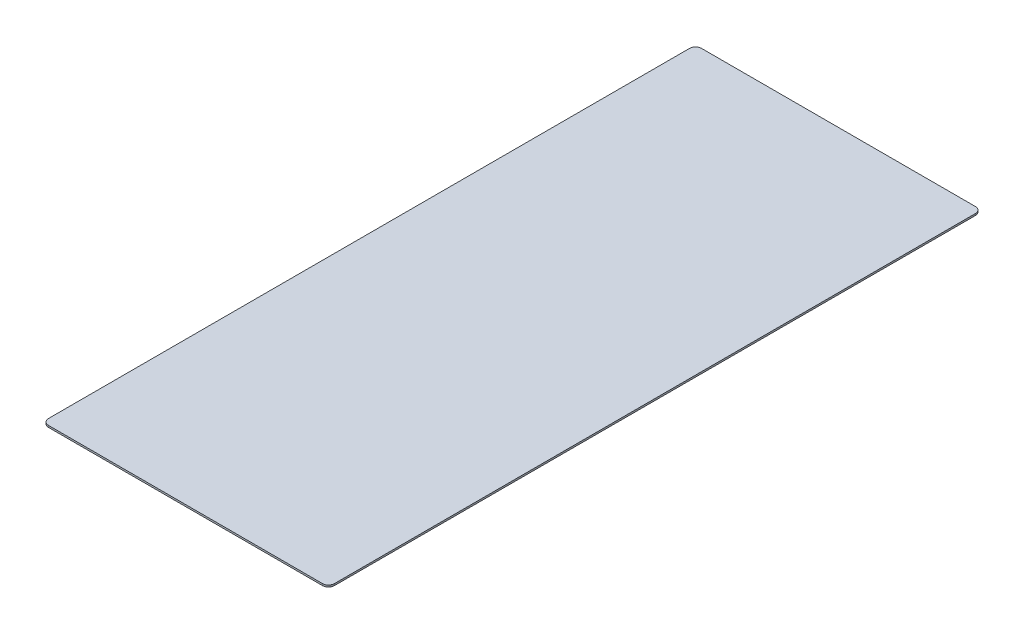
ISO-10303-21;
HEADER;
FILE_DESCRIPTION(('STEP AP214'),'2;1');
FILE_NAME('part.step','',(''),(''),'','','');
FILE_SCHEMA(('AUTOMOTIVE_DESIGN { 1 0 10303 214 1 1 1 1 }'));
ENDSEC;
DATA;
#1=APPLICATION_CONTEXT('core data for automotive mechanical design processes');
#2=APPLICATION_PROTOCOL_DEFINITION('international standard','automotive_design',2000,#1);
#3=PRODUCT_CONTEXT('',#1,'mechanical');
#4=PRODUCT('Part','Part','',(#3));
#5=PRODUCT_RELATED_PRODUCT_CATEGORY('part','',(#4));
#6=PRODUCT_DEFINITION_FORMATION('','',#4);
#7=PRODUCT_DEFINITION_CONTEXT('part definition',#1,'design');
#8=PRODUCT_DEFINITION('design','',#6,#7);
#9=PRODUCT_DEFINITION_SHAPE('','',#8);
#10=(LENGTH_UNIT() NAMED_UNIT(*) SI_UNIT(.MILLI.,.METRE.));
#11=(NAMED_UNIT(*) PLANE_ANGLE_UNIT() SI_UNIT($,.RADIAN.));
#12=(NAMED_UNIT(*) SI_UNIT($,.STERADIAN.) SOLID_ANGLE_UNIT());
#13=UNCERTAINTY_MEASURE_WITH_UNIT(LENGTH_MEASURE(1.E-05),#10,'distance_accuracy_value','');
#14=(GEOMETRIC_REPRESENTATION_CONTEXT(3) GLOBAL_UNCERTAINTY_ASSIGNED_CONTEXT((#13)) GLOBAL_UNIT_ASSIGNED_CONTEXT((#10,
#11,#12)) REPRESENTATION_CONTEXT('',''));
#15=CARTESIAN_POINT('',(0.,0.,0.));
#16=DIRECTION('',(0.,0.,1.));
#17=DIRECTION('',(1.,0.,0.));
#18=AXIS2_PLACEMENT_3D('',#15,#16,#17);
#19=CARTESIAN_POINT('',(231.5,3.,541.5));
#20=DIRECTION('',(0.,-1.,0.));
#21=DIRECTION('',(0.,0.,-1.));
#22=AXIS2_PLACEMENT_3D('',#19,#20,#21);
#23=CYLINDRICAL_SURFACE('',#22,10.);
#24=CARTESIAN_POINT('',(231.5,0.,541.5));
#25=DIRECTION('',(0.,1.,0.));
#26=DIRECTION('',(0.,0.,1.));
#27=AXIS2_PLACEMENT_3D('',#24,#25,#26);
#28=CIRCLE('',#27,10.);
#29=CARTESIAN_POINT('',(231.5,0.,551.5));
#30=VERTEX_POINT('',#29);
#31=CARTESIAN_POINT('',(241.5,0.,541.5));
#32=VERTEX_POINT('',#31);
#33=EDGE_CURVE('E140',#30,#32,#28,.T.);
#34=ORIENTED_EDGE('',*,*,#33,.T.);
#35=DIRECTION('',(0.,-1.,0.));
#36=VECTOR('',#35,1.);
#37=CARTESIAN_POINT('',(241.5,3.,541.5));
#38=LINE('',#37,#36);
#39=CARTESIAN_POINT('',(241.5,3.,541.5));
#40=VERTEX_POINT('',#39);
#41=EDGE_CURVE('E11',#40,#32,#38,.T.);
#42=ORIENTED_EDGE('',*,*,#41,.F.);
#43=CARTESIAN_POINT('',(231.5,3.,541.5));
#44=DIRECTION('',(0.,1.,0.));
#45=DIRECTION('',(0.,0.,1.));
#46=AXIS2_PLACEMENT_3D('',#43,#44,#45);
#47=CIRCLE('',#46,10.);
#48=CARTESIAN_POINT('',(231.5,3.,551.5));
#49=VERTEX_POINT('',#48);
#50=EDGE_CURVE('E162',#49,#40,#47,.T.);
#51=ORIENTED_EDGE('',*,*,#50,.F.);
#52=DIRECTION('',(0.,-1.,0.));
#53=VECTOR('',#52,1.);
#54=CARTESIAN_POINT('',(231.5,3.,551.5));
#55=LINE('',#54,#53);
#56=EDGE_CURVE('E136',#49,#30,#55,.T.);
#57=ORIENTED_EDGE('',*,*,#56,.T.);
#58=EDGE_LOOP('',(#34,#42,#51,#57));
#59=FACE_BOUND('',#58,.T.);
#60=ADVANCED_FACE('F39',(#59),#23,.T.);
#61=CARTESIAN_POINT('',(241.5,3.,541.5));
#62=DIRECTION('',(-1.,0.,0.));
#63=DIRECTION('',(0.,0.,1.));
#64=AXIS2_PLACEMENT_3D('',#61,#62,#63);
#65=PLANE('',#64);
#66=DIRECTION('',(0.,0.,-1.));
#67=VECTOR('',#66,1.);
#68=CARTESIAN_POINT('',(241.5,0.,541.5));
#69=LINE('',#68,#67);
#70=CARTESIAN_POINT('',(241.5,0.,-541.5));
#71=VERTEX_POINT('',#70);
#72=EDGE_CURVE('E144',#32,#71,#69,.T.);
#73=ORIENTED_EDGE('',*,*,#72,.T.);
#74=DIRECTION('',(0.,-1.,0.));
#75=VECTOR('',#74,1.);
#76=CARTESIAN_POINT('',(241.5,3.,-541.5));
#77=LINE('',#76,#75);
#78=CARTESIAN_POINT('',(241.5,3.,-541.5));
#79=VERTEX_POINT('',#78);
#80=EDGE_CURVE('E48',#79,#71,#77,.T.);
#81=ORIENTED_EDGE('',*,*,#80,.F.);
#82=DIRECTION('',(0.,0.,-1.));
#83=VECTOR('',#82,1.);
#84=CARTESIAN_POINT('',(241.5,3.,541.5));
#85=LINE('',#84,#83);
#86=EDGE_CURVE('E99',#40,#79,#85,.T.);
#87=ORIENTED_EDGE('',*,*,#86,.F.);
#88=ORIENTED_EDGE('',*,*,#41,.T.);
#89=EDGE_LOOP('',(#73,#81,#87,#88));
#90=FACE_BOUND('',#89,.T.);
#91=ADVANCED_FACE('F208',(#90),#65,.F.);
#92=CARTESIAN_POINT('',(231.5,3.,-541.5));
#93=DIRECTION('',(0.,-1.,0.));
#94=DIRECTION('',(0.,0.,-1.));
#95=AXIS2_PLACEMENT_3D('',#92,#93,#94);
#96=CYLINDRICAL_SURFACE('',#95,10.);
#97=CARTESIAN_POINT('',(231.5,0.,-541.5));
#98=DIRECTION('',(0.,1.,0.));
#99=DIRECTION('',(0.,0.,-1.));
#100=AXIS2_PLACEMENT_3D('',#97,#98,#99);
#101=CIRCLE('',#100,10.);
#102=CARTESIAN_POINT('',(231.5,0.,-551.5));
#103=VERTEX_POINT('',#102);
#104=EDGE_CURVE('E147',#71,#103,#101,.T.);
#105=ORIENTED_EDGE('',*,*,#104,.T.);
#106=DIRECTION('',(0.,-1.,0.));
#107=VECTOR('',#106,1.);
#108=CARTESIAN_POINT('',(231.5,3.,-551.5));
#109=LINE('',#108,#107);
#110=CARTESIAN_POINT('',(231.5,3.,-551.5));
#111=VERTEX_POINT('',#110);
#112=EDGE_CURVE('E173',#111,#103,#109,.T.);
#113=ORIENTED_EDGE('',*,*,#112,.F.);
#114=CARTESIAN_POINT('',(231.5,3.,-541.5));
#115=DIRECTION('',(0.,1.,0.));
#116=DIRECTION('',(0.,0.,-1.));
#117=AXIS2_PLACEMENT_3D('',#114,#115,#116);
#118=CIRCLE('',#117,10.);
#119=EDGE_CURVE('E183',#79,#111,#118,.T.);
#120=ORIENTED_EDGE('',*,*,#119,.F.);
#121=ORIENTED_EDGE('',*,*,#80,.T.);
#122=EDGE_LOOP('',(#105,#113,#120,#121));
#123=FACE_BOUND('',#122,.T.);
#124=ADVANCED_FACE('F181',(#123),#96,.T.);
#125=CARTESIAN_POINT('',(-231.5,3.,-551.5));
#126=DIRECTION('',(0.,0.,1.));
#127=DIRECTION('',(1.,0.,0.));
#128=AXIS2_PLACEMENT_3D('',#125,#126,#127);
#129=PLANE('',#128);
#130=DIRECTION('',(-1.,0.,0.));
#131=VECTOR('',#130,1.);
#132=CARTESIAN_POINT('',(-231.5,0.,-551.5));
#133=LINE('',#132,#131);
#134=CARTESIAN_POINT('',(-231.5,0.,-551.5));
#135=VERTEX_POINT('',#134);
#136=EDGE_CURVE('E150',#103,#135,#133,.T.);
#137=ORIENTED_EDGE('',*,*,#136,.T.);
#138=DIRECTION('',(0.,-1.,0.));
#139=VECTOR('',#138,1.);
#140=CARTESIAN_POINT('',(-231.5,3.,-551.5));
#141=LINE('',#140,#139);
#142=CARTESIAN_POINT('',(-231.5,3.,-551.5));
#143=VERTEX_POINT('',#142);
#144=EDGE_CURVE('E169',#143,#135,#141,.T.);
#145=ORIENTED_EDGE('',*,*,#144,.F.);
#146=DIRECTION('',(-1.,0.,0.));
#147=VECTOR('',#146,1.);
#148=CARTESIAN_POINT('',(-231.5,3.,-551.5));
#149=LINE('',#148,#147);
#150=EDGE_CURVE('E196',#111,#143,#149,.T.);
#151=ORIENTED_EDGE('',*,*,#150,.F.);
#152=ORIENTED_EDGE('',*,*,#112,.T.);
#153=EDGE_LOOP('',(#137,#145,#151,#152));
#154=FACE_BOUND('',#153,.T.);
#155=ADVANCED_FACE('F191',(#154),#129,.F.);
#156=CARTESIAN_POINT('',(-231.5,3.,-541.5));
#157=DIRECTION('',(0.,-1.,0.));
#158=DIRECTION('',(0.,0.,-1.));
#159=AXIS2_PLACEMENT_3D('',#156,#157,#158);
#160=CYLINDRICAL_SURFACE('',#159,10.);
#161=CARTESIAN_POINT('',(-231.5,0.,-541.5));
#162=DIRECTION('',(0.,1.,0.));
#163=DIRECTION('',(0.,0.,-1.));
#164=AXIS2_PLACEMENT_3D('',#161,#162,#163);
#165=CIRCLE('',#164,10.);
#166=CARTESIAN_POINT('',(-241.5,0.,-541.5));
#167=VERTEX_POINT('',#166);
#168=EDGE_CURVE('E153',#135,#167,#165,.T.);
#169=ORIENTED_EDGE('',*,*,#168,.T.);
#170=DIRECTION('',(0.,-1.,0.));
#171=VECTOR('',#170,1.);
#172=CARTESIAN_POINT('',(-241.5,3.,-541.5));
#173=LINE('',#172,#171);
#174=CARTESIAN_POINT('',(-241.5,3.,-541.5));
#175=VERTEX_POINT('',#174);
#176=EDGE_CURVE('E129',#175,#167,#173,.T.);
#177=ORIENTED_EDGE('',*,*,#176,.F.);
#178=CARTESIAN_POINT('',(-231.5,3.,-541.5));
#179=DIRECTION('',(0.,1.,0.));
#180=DIRECTION('',(0.,0.,-1.));
#181=AXIS2_PLACEMENT_3D('',#178,#179,#180);
#182=CIRCLE('',#181,10.);
#183=EDGE_CURVE('E118',#143,#175,#182,.T.);
#184=ORIENTED_EDGE('',*,*,#183,.F.);
#185=ORIENTED_EDGE('',*,*,#144,.T.);
#186=EDGE_LOOP('',(#169,#177,#184,#185));
#187=FACE_BOUND('',#186,.T.);
#188=ADVANCED_FACE('F194',(#187),#160,.T.);
#189=CARTESIAN_POINT('',(-241.5,3.,541.5));
#190=DIRECTION('',(1.,0.,0.));
#191=DIRECTION('',(0.,0.,-1.));
#192=AXIS2_PLACEMENT_3D('',#189,#190,#191);
#193=PLANE('',#192);
#194=DIRECTION('',(0.,0.,1.));
#195=VECTOR('',#194,1.);
#196=CARTESIAN_POINT('',(-241.5,0.,541.5));
#197=LINE('',#196,#195);
#198=CARTESIAN_POINT('',(-241.5,0.,541.5));
#199=VERTEX_POINT('',#198);
#200=EDGE_CURVE('E127',#167,#199,#197,.T.);
#201=ORIENTED_EDGE('',*,*,#200,.T.);
#202=DIRECTION('',(0.,-1.,0.));
#203=VECTOR('',#202,1.);
#204=CARTESIAN_POINT('',(-241.5,3.,541.5));
#205=LINE('',#204,#203);
#206=CARTESIAN_POINT('',(-241.5,3.,541.5));
#207=VERTEX_POINT('',#206);
#208=EDGE_CURVE('E124',#207,#199,#205,.T.);
#209=ORIENTED_EDGE('',*,*,#208,.F.);
#210=DIRECTION('',(0.,0.,1.));
#211=VECTOR('',#210,1.);
#212=CARTESIAN_POINT('',(-241.5,3.,541.5));
#213=LINE('',#212,#211);
#214=EDGE_CURVE('E112',#175,#207,#213,.T.);
#215=ORIENTED_EDGE('',*,*,#214,.F.);
#216=ORIENTED_EDGE('',*,*,#176,.T.);
#217=EDGE_LOOP('',(#201,#209,#215,#216));
#218=FACE_BOUND('',#217,.T.);
#219=ADVANCED_FACE('F125',(#218),#193,.F.);
#220=CARTESIAN_POINT('',(-231.5,3.,541.5));
#221=DIRECTION('',(0.,-1.,0.));
#222=DIRECTION('',(0.,0.,-1.));
#223=AXIS2_PLACEMENT_3D('',#220,#221,#222);
#224=CYLINDRICAL_SURFACE('',#223,10.);
#225=CARTESIAN_POINT('',(-231.5,0.,541.5));
#226=DIRECTION('',(0.,1.,0.));
#227=DIRECTION('',(0.,0.,-1.));
#228=AXIS2_PLACEMENT_3D('',#225,#226,#227);
#229=CIRCLE('',#228,10.);
#230=CARTESIAN_POINT('',(-231.5,0.,551.5));
#231=VERTEX_POINT('',#230);
#232=EDGE_CURVE('E85',#199,#231,#229,.T.);
#233=ORIENTED_EDGE('',*,*,#232,.T.);
#234=DIRECTION('',(0.,-1.,0.));
#235=VECTOR('',#234,1.);
#236=CARTESIAN_POINT('',(-231.5,3.,551.5));
#237=LINE('',#236,#235);
#238=CARTESIAN_POINT('',(-231.5,3.,551.5));
#239=VERTEX_POINT('',#238);
#240=EDGE_CURVE('E130',#239,#231,#237,.T.);
#241=ORIENTED_EDGE('',*,*,#240,.F.);
#242=CARTESIAN_POINT('',(-231.5,3.,541.5));
#243=DIRECTION('',(0.,1.,0.));
#244=DIRECTION('',(0.,0.,-1.));
#245=AXIS2_PLACEMENT_3D('',#242,#243,#244);
#246=CIRCLE('',#245,10.);
#247=EDGE_CURVE('E116',#207,#239,#246,.T.);
#248=ORIENTED_EDGE('',*,*,#247,.F.);
#249=ORIENTED_EDGE('',*,*,#208,.T.);
#250=EDGE_LOOP('',(#233,#241,#248,#249));
#251=FACE_BOUND('',#250,.T.);
#252=ADVANCED_FACE('F132',(#251),#224,.T.);
#253=CARTESIAN_POINT('',(-231.5,3.,551.5));
#254=DIRECTION('',(0.,0.,-1.));
#255=DIRECTION('',(-1.,0.,0.));
#256=AXIS2_PLACEMENT_3D('',#253,#254,#255);
#257=PLANE('',#256);
#258=DIRECTION('',(1.,0.,0.));
#259=VECTOR('',#258,1.);
#260=CARTESIAN_POINT('',(-231.5,0.,551.5));
#261=LINE('',#260,#259);
#262=EDGE_CURVE('E91',#231,#30,#261,.T.);
#263=ORIENTED_EDGE('',*,*,#262,.T.);
#264=ORIENTED_EDGE('',*,*,#56,.F.);
#265=DIRECTION('',(1.,0.,0.));
#266=VECTOR('',#265,1.);
#267=CARTESIAN_POINT('',(-231.5,3.,551.5));
#268=LINE('',#267,#266);
#269=EDGE_CURVE('E56',#239,#49,#268,.T.);
#270=ORIENTED_EDGE('',*,*,#269,.F.);
#271=ORIENTED_EDGE('',*,*,#240,.T.);
#272=EDGE_LOOP('',(#263,#264,#270,#271));
#273=FACE_BOUND('',#272,.T.);
#274=ADVANCED_FACE('F224',(#273),#257,.F.);
#275=CARTESIAN_POINT('',(231.5,3.,541.5));
#276=DIRECTION('',(0.,1.,0.));
#277=DIRECTION('',(0.,0.,1.));
#278=AXIS2_PLACEMENT_3D('',#275,#276,#277);
#279=PLANE('',#278);
#280=ORIENTED_EDGE('',*,*,#50,.T.);
#281=ORIENTED_EDGE('',*,*,#86,.T.);
#282=ORIENTED_EDGE('',*,*,#119,.T.);
#283=ORIENTED_EDGE('',*,*,#150,.T.);
#284=ORIENTED_EDGE('',*,*,#183,.T.);
#285=ORIENTED_EDGE('',*,*,#214,.T.);
#286=ORIENTED_EDGE('',*,*,#247,.T.);
#287=ORIENTED_EDGE('',*,*,#269,.T.);
#288=EDGE_LOOP('',(#280,#281,#282,#283,#284,#285,#286,#287));
#289=FACE_BOUND('',#288,.T.);
#290=ADVANCED_FACE('F114',(#289),#279,.T.);
#291=CARTESIAN_POINT('',(231.5,0.,541.5));
#292=DIRECTION('',(0.,1.,0.));
#293=DIRECTION('',(0.,0.,1.));
#294=AXIS2_PLACEMENT_3D('',#291,#292,#293);
#295=PLANE('',#294);
#296=ORIENTED_EDGE('',*,*,#33,.F.);
#297=ORIENTED_EDGE('',*,*,#262,.F.);
#298=ORIENTED_EDGE('',*,*,#232,.F.);
#299=ORIENTED_EDGE('',*,*,#200,.F.);
#300=ORIENTED_EDGE('',*,*,#168,.F.);
#301=ORIENTED_EDGE('',*,*,#136,.F.);
#302=ORIENTED_EDGE('',*,*,#104,.F.);
#303=ORIENTED_EDGE('',*,*,#72,.F.);
#304=EDGE_LOOP('',(#296,#297,#298,#299,#300,#301,#302,#303));
#305=FACE_BOUND('',#304,.T.);
#306=ADVANCED_FACE('F187',(#305),#295,.F.);
#307=CLOSED_SHELL('',(#60,#91,#124,#155,#188,#219,#252,#274,#290,#306));
#308=MANIFOLD_SOLID_BREP('B2',#307);
#309=ADVANCED_BREP_SHAPE_REPRESENTATION('',(#18,#308),#14);
#310=SHAPE_DEFINITION_REPRESENTATION(#9,#309);
ENDSEC;
END-ISO-10303-21;
